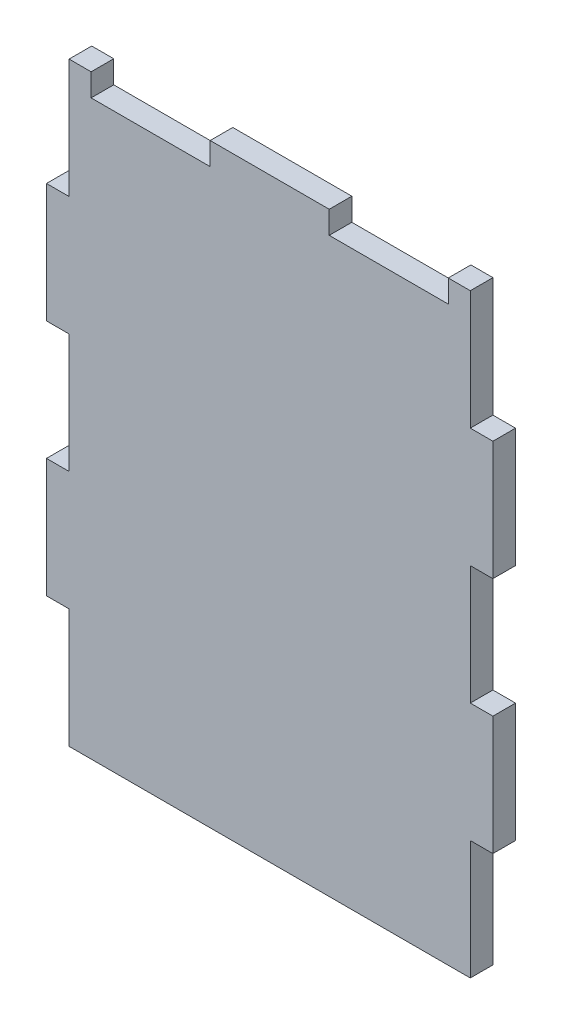
ISO-10303-21;
HEADER;
FILE_DESCRIPTION(('STEP AP214'),'2;1');
FILE_NAME('part.step','',(''),(''),'','','');
FILE_SCHEMA(('AUTOMOTIVE_DESIGN { 1 0 10303 214 1 1 1 1 }'));
ENDSEC;
DATA;
#1=APPLICATION_CONTEXT('core data for automotive mechanical design processes');
#2=APPLICATION_PROTOCOL_DEFINITION('international standard','automotive_design',2000,#1);
#3=PRODUCT_CONTEXT('',#1,'mechanical');
#4=PRODUCT('Part','Part','',(#3));
#5=PRODUCT_RELATED_PRODUCT_CATEGORY('part','',(#4));
#6=PRODUCT_DEFINITION_FORMATION('','',#4);
#7=PRODUCT_DEFINITION_CONTEXT('part definition',#1,'design');
#8=PRODUCT_DEFINITION('design','',#6,#7);
#9=PRODUCT_DEFINITION_SHAPE('','',#8);
#10=(LENGTH_UNIT() NAMED_UNIT(*) SI_UNIT(.MILLI.,.METRE.));
#11=(NAMED_UNIT(*) PLANE_ANGLE_UNIT() SI_UNIT($,.RADIAN.));
#12=(NAMED_UNIT(*) SI_UNIT($,.STERADIAN.) SOLID_ANGLE_UNIT());
#13=UNCERTAINTY_MEASURE_WITH_UNIT(LENGTH_MEASURE(1.E-05),#10,'distance_accuracy_value','');
#14=(GEOMETRIC_REPRESENTATION_CONTEXT(3) GLOBAL_UNCERTAINTY_ASSIGNED_CONTEXT((#13)) GLOBAL_UNIT_ASSIGNED_CONTEXT((#10,
#11,#12)) REPRESENTATION_CONTEXT('',''));
#15=CARTESIAN_POINT('',(0.,0.,0.));
#16=DIRECTION('',(0.,0.,1.));
#17=DIRECTION('',(1.,0.,0.));
#18=AXIS2_PLACEMENT_3D('',#15,#16,#17);
#19=CARTESIAN_POINT('',(4.826,127.,4.826));
#20=DIRECTION('',(0.,-1.,0.));
#21=DIRECTION('',(0.,0.,-1.));
#22=AXIS2_PLACEMENT_3D('',#19,#20,#21);
#23=PLANE('',#22);
#24=DIRECTION('',(0.,0.,-1.));
#25=VECTOR('',#24,1.);
#26=CARTESIAN_POINT('',(9.52500000000001,127.,0.));
#27=LINE('',#26,#25);
#28=CARTESIAN_POINT('',(9.52500000000001,127.,4.826));
#29=VERTEX_POINT('',#28);
#30=CARTESIAN_POINT('',(9.52500000000001,127.,0.));
#31=VERTEX_POINT('',#30);
#32=EDGE_CURVE('E224',#29,#31,#27,.T.);
#33=ORIENTED_EDGE('',*,*,#32,.T.);
#34=DIRECTION('',(-1.,0.,0.));
#35=VECTOR('',#34,1.);
#36=CARTESIAN_POINT('',(4.826,127.,0.));
#37=LINE('',#36,#35);
#38=CARTESIAN_POINT('',(4.826,127.,0.));
#39=VERTEX_POINT('',#38);
#40=EDGE_CURVE('E359',#31,#39,#37,.T.);
#41=ORIENTED_EDGE('',*,*,#40,.T.);
#42=DIRECTION('',(0.,0.,-1.));
#43=VECTOR('',#42,1.);
#44=CARTESIAN_POINT('',(4.826,127.,4.826));
#45=LINE('',#44,#43);
#46=CARTESIAN_POINT('',(4.826,127.,4.826));
#47=VERTEX_POINT('',#46);
#48=EDGE_CURVE('E319',#47,#39,#45,.T.);
#49=ORIENTED_EDGE('',*,*,#48,.F.);
#50=DIRECTION('',(-1.,0.,0.));
#51=VECTOR('',#50,1.);
#52=CARTESIAN_POINT('',(4.826,127.,4.826));
#53=LINE('',#52,#51);
#54=EDGE_CURVE('E315',#29,#47,#53,.T.);
#55=ORIENTED_EDGE('',*,*,#54,.F.);
#56=EDGE_LOOP('',(#33,#41,#49,#55));
#57=FACE_BOUND('',#56,.T.);
#58=ADVANCED_FACE('F33',(#57),#23,.F.);
#59=CARTESIAN_POINT('',(0.,0.,4.826));
#60=DIRECTION('',(0.,0.,1.));
#61=DIRECTION('',(1.,0.,0.));
#62=AXIS2_PLACEMENT_3D('',#59,#60,#61);
#63=PLANE('',#62);
#64=DIRECTION('',(1.,0.,0.));
#65=VECTOR('',#64,1.);
#66=CARTESIAN_POINT('',(0.,122.174,4.826));
#67=LINE('',#66,#65);
#68=CARTESIAN_POINT('',(9.52500000000001,122.174,4.826));
#69=VERTEX_POINT('',#68);
#70=CARTESIAN_POINT('',(34.925,122.174,4.826));
#71=VERTEX_POINT('',#70);
#72=EDGE_CURVE('E232',#69,#71,#67,.T.);
#73=ORIENTED_EDGE('',*,*,#72,.F.);
#74=DIRECTION('',(0.,1.,0.));
#75=VECTOR('',#74,1.);
#76=CARTESIAN_POINT('',(9.52500000000001,122.174,4.826));
#77=LINE('',#76,#75);
#78=EDGE_CURVE('E219',#69,#29,#77,.T.);
#79=ORIENTED_EDGE('',*,*,#78,.T.);
#80=ORIENTED_EDGE('',*,*,#54,.T.);
#81=DIRECTION('',(0.,-1.,0.));
#82=VECTOR('',#81,1.);
#83=CARTESIAN_POINT('',(4.826,127.,4.826));
#84=LINE('',#83,#82);
#85=CARTESIAN_POINT('',(4.826,101.6,4.826));
#86=VERTEX_POINT('',#85);
#87=EDGE_CURVE('E275',#47,#86,#84,.T.);
#88=ORIENTED_EDGE('',*,*,#87,.T.);
#89=DIRECTION('',(-1.,0.,0.));
#90=VECTOR('',#89,1.);
#91=CARTESIAN_POINT('',(0.,101.6,4.826));
#92=LINE('',#91,#90);
#93=CARTESIAN_POINT('',(0.,101.6,4.826));
#94=VERTEX_POINT('',#93);
#95=EDGE_CURVE('E278',#86,#94,#92,.T.);
#96=ORIENTED_EDGE('',*,*,#95,.T.);
#97=DIRECTION('',(0.,-1.,0.));
#98=VECTOR('',#97,1.);
#99=CARTESIAN_POINT('',(0.,76.2,4.826));
#100=LINE('',#99,#98);
#101=CARTESIAN_POINT('',(0.,76.2,4.826));
#102=VERTEX_POINT('',#101);
#103=EDGE_CURVE('E281',#94,#102,#100,.T.);
#104=ORIENTED_EDGE('',*,*,#103,.T.);
#105=DIRECTION('',(1.,0.,0.));
#106=VECTOR('',#105,1.);
#107=CARTESIAN_POINT('',(0.,76.2,4.826));
#108=LINE('',#107,#106);
#109=CARTESIAN_POINT('',(4.826,76.2,4.826));
#110=VERTEX_POINT('',#109);
#111=EDGE_CURVE('E283',#102,#110,#108,.T.);
#112=ORIENTED_EDGE('',*,*,#111,.T.);
#113=DIRECTION('',(0.,-1.,0.));
#114=VECTOR('',#113,1.);
#115=CARTESIAN_POINT('',(4.826,76.2,4.826));
#116=LINE('',#115,#114);
#117=CARTESIAN_POINT('',(4.826,50.8,4.826));
#118=VERTEX_POINT('',#117);
#119=EDGE_CURVE('E285',#110,#118,#116,.T.);
#120=ORIENTED_EDGE('',*,*,#119,.T.);
#121=DIRECTION('',(-1.,0.,0.));
#122=VECTOR('',#121,1.);
#123=CARTESIAN_POINT('',(0.,50.8,4.826));
#124=LINE('',#123,#122);
#125=CARTESIAN_POINT('',(0.,50.8,4.826));
#126=VERTEX_POINT('',#125);
#127=EDGE_CURVE('E287',#118,#126,#124,.T.);
#128=ORIENTED_EDGE('',*,*,#127,.T.);
#129=DIRECTION('',(0.,-1.,0.));
#130=VECTOR('',#129,1.);
#131=CARTESIAN_POINT('',(0.,25.4,4.826));
#132=LINE('',#131,#130);
#133=CARTESIAN_POINT('',(0.,25.4,4.826));
#134=VERTEX_POINT('',#133);
#135=EDGE_CURVE('E289',#126,#134,#132,.T.);
#136=ORIENTED_EDGE('',*,*,#135,.T.);
#137=DIRECTION('',(1.,0.,0.));
#138=VECTOR('',#137,1.);
#139=CARTESIAN_POINT('',(0.,25.4,4.826));
#140=LINE('',#139,#138);
#141=CARTESIAN_POINT('',(4.826,25.4,4.826));
#142=VERTEX_POINT('',#141);
#143=EDGE_CURVE('E291',#134,#142,#140,.T.);
#144=ORIENTED_EDGE('',*,*,#143,.T.);
#145=DIRECTION('',(0.,-1.,0.));
#146=VECTOR('',#145,1.);
#147=CARTESIAN_POINT('',(4.826,25.4,4.826));
#148=LINE('',#147,#146);
#149=CARTESIAN_POINT('',(4.826,0.,4.826));
#150=VERTEX_POINT('',#149);
#151=EDGE_CURVE('E293',#142,#150,#148,.T.);
#152=ORIENTED_EDGE('',*,*,#151,.T.);
#153=DIRECTION('',(1.,0.,0.));
#154=VECTOR('',#153,1.);
#155=CARTESIAN_POINT('',(4.826,0.,4.826));
#156=LINE('',#155,#154);
#157=CARTESIAN_POINT('',(90.424,0.,4.826));
#158=VERTEX_POINT('',#157);
#159=EDGE_CURVE('E295',#150,#158,#156,.T.);
#160=ORIENTED_EDGE('',*,*,#159,.T.);
#161=DIRECTION('',(0.,1.,0.));
#162=VECTOR('',#161,1.);
#163=CARTESIAN_POINT('',(90.424,25.4,4.826));
#164=LINE('',#163,#162);
#165=CARTESIAN_POINT('',(90.424,25.4,4.826));
#166=VERTEX_POINT('',#165);
#167=EDGE_CURVE('E297',#158,#166,#164,.T.);
#168=ORIENTED_EDGE('',*,*,#167,.T.);
#169=DIRECTION('',(1.,0.,0.));
#170=VECTOR('',#169,1.);
#171=CARTESIAN_POINT('',(95.25,25.4,4.826));
#172=LINE('',#171,#170);
#173=CARTESIAN_POINT('',(95.25,25.4,4.826));
#174=VERTEX_POINT('',#173);
#175=EDGE_CURVE('E299',#166,#174,#172,.T.);
#176=ORIENTED_EDGE('',*,*,#175,.T.);
#177=DIRECTION('',(0.,1.,0.));
#178=VECTOR('',#177,1.);
#179=CARTESIAN_POINT('',(95.25,25.4,4.826));
#180=LINE('',#179,#178);
#181=CARTESIAN_POINT('',(95.25,50.8,4.826));
#182=VERTEX_POINT('',#181);
#183=EDGE_CURVE('E301',#174,#182,#180,.T.);
#184=ORIENTED_EDGE('',*,*,#183,.T.);
#185=DIRECTION('',(-1.,0.,0.));
#186=VECTOR('',#185,1.);
#187=CARTESIAN_POINT('',(95.25,50.8,4.826));
#188=LINE('',#187,#186);
#189=CARTESIAN_POINT('',(90.424,50.8,4.826));
#190=VERTEX_POINT('',#189);
#191=EDGE_CURVE('E303',#182,#190,#188,.T.);
#192=ORIENTED_EDGE('',*,*,#191,.T.);
#193=DIRECTION('',(0.,1.,0.));
#194=VECTOR('',#193,1.);
#195=CARTESIAN_POINT('',(90.424,76.2,4.826));
#196=LINE('',#195,#194);
#197=CARTESIAN_POINT('',(90.424,76.2,4.826));
#198=VERTEX_POINT('',#197);
#199=EDGE_CURVE('E305',#190,#198,#196,.T.);
#200=ORIENTED_EDGE('',*,*,#199,.T.);
#201=DIRECTION('',(1.,0.,0.));
#202=VECTOR('',#201,1.);
#203=CARTESIAN_POINT('',(95.25,76.2,4.826));
#204=LINE('',#203,#202);
#205=CARTESIAN_POINT('',(95.25,76.2,4.826));
#206=VERTEX_POINT('',#205);
#207=EDGE_CURVE('E307',#198,#206,#204,.T.);
#208=ORIENTED_EDGE('',*,*,#207,.T.);
#209=DIRECTION('',(0.,1.,0.));
#210=VECTOR('',#209,1.);
#211=CARTESIAN_POINT('',(95.25,76.2,4.826));
#212=LINE('',#211,#210);
#213=CARTESIAN_POINT('',(95.25,101.6,4.826));
#214=VERTEX_POINT('',#213);
#215=EDGE_CURVE('E309',#206,#214,#212,.T.);
#216=ORIENTED_EDGE('',*,*,#215,.T.);
#217=DIRECTION('',(-1.,0.,0.));
#218=VECTOR('',#217,1.);
#219=CARTESIAN_POINT('',(90.424,101.6,4.826));
#220=LINE('',#219,#218);
#221=CARTESIAN_POINT('',(90.424,101.6,4.826));
#222=VERTEX_POINT('',#221);
#223=EDGE_CURVE('E311',#214,#222,#220,.T.);
#224=ORIENTED_EDGE('',*,*,#223,.T.);
#225=DIRECTION('',(0.,1.,0.));
#226=VECTOR('',#225,1.);
#227=CARTESIAN_POINT('',(90.424,127.,4.826));
#228=LINE('',#227,#226);
#229=CARTESIAN_POINT('',(90.424,127.,4.826));
#230=VERTEX_POINT('',#229);
#231=EDGE_CURVE('E313',#222,#230,#228,.T.);
#232=ORIENTED_EDGE('',*,*,#231,.T.);
#233=CARTESIAN_POINT('',(85.7250000000001,127.,4.826));
#234=VERTEX_POINT('',#233);
#235=EDGE_CURVE('E316',#230,#234,#53,.T.);
#236=ORIENTED_EDGE('',*,*,#235,.T.);
#237=DIRECTION('',(0.,1.,0.));
#238=VECTOR('',#237,1.);
#239=CARTESIAN_POINT('',(85.7250000000001,122.174,4.826));
#240=LINE('',#239,#238);
#241=CARTESIAN_POINT('',(85.7250000000001,122.174,4.826));
#242=VERTEX_POINT('',#241);
#243=EDGE_CURVE('E261',#242,#234,#240,.T.);
#244=ORIENTED_EDGE('',*,*,#243,.F.);
#245=DIRECTION('',(1.,0.,0.));
#246=VECTOR('',#245,1.);
#247=CARTESIAN_POINT('',(0.,122.174,4.826));
#248=LINE('',#247,#246);
#249=CARTESIAN_POINT('',(60.325,122.174,4.826));
#250=VERTEX_POINT('',#249);
#251=EDGE_CURVE('E253',#250,#242,#248,.T.);
#252=ORIENTED_EDGE('',*,*,#251,.F.);
#253=DIRECTION('',(0.,1.,0.));
#254=VECTOR('',#253,1.);
#255=CARTESIAN_POINT('',(60.325,122.174,4.826));
#256=LINE('',#255,#254);
#257=CARTESIAN_POINT('',(60.325,127.,4.826));
#258=VERTEX_POINT('',#257);
#259=EDGE_CURVE('E265',#250,#258,#256,.T.);
#260=ORIENTED_EDGE('',*,*,#259,.T.);
#261=CARTESIAN_POINT('',(34.925,127.,4.826));
#262=VERTEX_POINT('',#261);
#263=EDGE_CURVE('E320',#258,#262,#53,.T.);
#264=ORIENTED_EDGE('',*,*,#263,.T.);
#265=DIRECTION('',(0.,1.,0.));
#266=VECTOR('',#265,1.);
#267=CARTESIAN_POINT('',(34.925,122.174,4.826));
#268=LINE('',#267,#266);
#269=EDGE_CURVE('E228',#71,#262,#268,.T.);
#270=ORIENTED_EDGE('',*,*,#269,.F.);
#271=EDGE_LOOP('',(#73,#79,#80,#88,#96,#104,#112,#120,#128,#136,#144,#152,#160,#168,#176,#184,
#192,#200,#208,#216,#224,#232,#236,#244,#252,#260,#264,#270));
#272=FACE_BOUND('',#271,.T.);
#273=ADVANCED_FACE('F238',(#272),#63,.T.);
#274=CARTESIAN_POINT('',(0.,0.,0.));
#275=DIRECTION('',(0.,0.,1.));
#276=DIRECTION('',(1.,0.,0.));
#277=AXIS2_PLACEMENT_3D('',#274,#275,#276);
#278=PLANE('',#277);
#279=DIRECTION('',(0.,1.,0.));
#280=VECTOR('',#279,1.);
#281=CARTESIAN_POINT('',(9.52500000000001,122.174,0.));
#282=LINE('',#281,#280);
#283=CARTESIAN_POINT('',(9.52500000000001,122.174,0.));
#284=VERTEX_POINT('',#283);
#285=EDGE_CURVE('E246',#284,#31,#282,.T.);
#286=ORIENTED_EDGE('',*,*,#285,.F.);
#287=DIRECTION('',(-1.,0.,0.));
#288=VECTOR('',#287,1.);
#289=CARTESIAN_POINT('',(0.,122.174,0.));
#290=LINE('',#289,#288);
#291=CARTESIAN_POINT('',(34.925,122.174,0.));
#292=VERTEX_POINT('',#291);
#293=EDGE_CURVE('E229',#292,#284,#290,.T.);
#294=ORIENTED_EDGE('',*,*,#293,.F.);
#295=DIRECTION('',(0.,1.,0.));
#296=VECTOR('',#295,1.);
#297=CARTESIAN_POINT('',(34.925,122.174,0.));
#298=LINE('',#297,#296);
#299=CARTESIAN_POINT('',(34.925,127.,0.));
#300=VERTEX_POINT('',#299);
#301=EDGE_CURVE('E249',#292,#300,#298,.T.);
#302=ORIENTED_EDGE('',*,*,#301,.T.);
#303=CARTESIAN_POINT('',(60.325,127.,0.));
#304=VERTEX_POINT('',#303);
#305=EDGE_CURVE('E362',#304,#300,#37,.T.);
#306=ORIENTED_EDGE('',*,*,#305,.F.);
#307=DIRECTION('',(0.,1.,0.));
#308=VECTOR('',#307,1.);
#309=CARTESIAN_POINT('',(60.325,122.174,0.));
#310=LINE('',#309,#308);
#311=CARTESIAN_POINT('',(60.325,122.174,0.));
#312=VERTEX_POINT('',#311);
#313=EDGE_CURVE('E269',#312,#304,#310,.T.);
#314=ORIENTED_EDGE('',*,*,#313,.F.);
#315=DIRECTION('',(-1.,0.,0.));
#316=VECTOR('',#315,1.);
#317=CARTESIAN_POINT('',(0.,122.174,0.));
#318=LINE('',#317,#316);
#319=CARTESIAN_POINT('',(85.7250000000001,122.174,0.));
#320=VERTEX_POINT('',#319);
#321=EDGE_CURVE('E257',#320,#312,#318,.T.);
#322=ORIENTED_EDGE('',*,*,#321,.F.);
#323=DIRECTION('',(0.,1.,0.));
#324=VECTOR('',#323,1.);
#325=CARTESIAN_POINT('',(85.7250000000001,122.174,0.));
#326=LINE('',#325,#324);
#327=CARTESIAN_POINT('',(85.7250000000001,127.,0.));
#328=VERTEX_POINT('',#327);
#329=EDGE_CURVE('E271',#320,#328,#326,.T.);
#330=ORIENTED_EDGE('',*,*,#329,.T.);
#331=CARTESIAN_POINT('',(90.424,127.,0.));
#332=VERTEX_POINT('',#331);
#333=EDGE_CURVE('E279',#332,#328,#37,.T.);
#334=ORIENTED_EDGE('',*,*,#333,.F.);
#335=DIRECTION('',(0.,1.,0.));
#336=VECTOR('',#335,1.);
#337=CARTESIAN_POINT('',(90.424,127.,0.));
#338=LINE('',#337,#336);
#339=CARTESIAN_POINT('',(90.424,101.6,0.));
#340=VERTEX_POINT('',#339);
#341=EDGE_CURVE('E357',#340,#332,#338,.T.);
#342=ORIENTED_EDGE('',*,*,#341,.F.);
#343=DIRECTION('',(-1.,0.,0.));
#344=VECTOR('',#343,1.);
#345=CARTESIAN_POINT('',(90.424,101.6,0.));
#346=LINE('',#345,#344);
#347=CARTESIAN_POINT('',(95.25,101.6,0.));
#348=VERTEX_POINT('',#347);
#349=EDGE_CURVE('E355',#348,#340,#346,.T.);
#350=ORIENTED_EDGE('',*,*,#349,.F.);
#351=DIRECTION('',(0.,1.,0.));
#352=VECTOR('',#351,1.);
#353=CARTESIAN_POINT('',(95.25,76.2,0.));
#354=LINE('',#353,#352);
#355=CARTESIAN_POINT('',(95.25,76.2,0.));
#356=VERTEX_POINT('',#355);
#357=EDGE_CURVE('E353',#356,#348,#354,.T.);
#358=ORIENTED_EDGE('',*,*,#357,.F.);
#359=DIRECTION('',(1.,0.,0.));
#360=VECTOR('',#359,1.);
#361=CARTESIAN_POINT('',(95.25,76.2,0.));
#362=LINE('',#361,#360);
#363=CARTESIAN_POINT('',(90.424,76.2,0.));
#364=VERTEX_POINT('',#363);
#365=EDGE_CURVE('E351',#364,#356,#362,.T.);
#366=ORIENTED_EDGE('',*,*,#365,.F.);
#367=DIRECTION('',(0.,1.,0.));
#368=VECTOR('',#367,1.);
#369=CARTESIAN_POINT('',(90.424,76.2,0.));
#370=LINE('',#369,#368);
#371=CARTESIAN_POINT('',(90.424,50.8,0.));
#372=VERTEX_POINT('',#371);
#373=EDGE_CURVE('E349',#372,#364,#370,.T.);
#374=ORIENTED_EDGE('',*,*,#373,.F.);
#375=DIRECTION('',(-1.,0.,0.));
#376=VECTOR('',#375,1.);
#377=CARTESIAN_POINT('',(95.25,50.8,0.));
#378=LINE('',#377,#376);
#379=CARTESIAN_POINT('',(95.25,50.8,0.));
#380=VERTEX_POINT('',#379);
#381=EDGE_CURVE('E347',#380,#372,#378,.T.);
#382=ORIENTED_EDGE('',*,*,#381,.F.);
#383=DIRECTION('',(0.,1.,0.));
#384=VECTOR('',#383,1.);
#385=CARTESIAN_POINT('',(95.25,25.4,0.));
#386=LINE('',#385,#384);
#387=CARTESIAN_POINT('',(95.25,25.4,0.));
#388=VERTEX_POINT('',#387);
#389=EDGE_CURVE('E345',#388,#380,#386,.T.);
#390=ORIENTED_EDGE('',*,*,#389,.F.);
#391=DIRECTION('',(1.,0.,0.));
#392=VECTOR('',#391,1.);
#393=CARTESIAN_POINT('',(95.25,25.4,0.));
#394=LINE('',#393,#392);
#395=CARTESIAN_POINT('',(90.424,25.4,0.));
#396=VERTEX_POINT('',#395);
#397=EDGE_CURVE('E343',#396,#388,#394,.T.);
#398=ORIENTED_EDGE('',*,*,#397,.F.);
#399=DIRECTION('',(0.,1.,0.));
#400=VECTOR('',#399,1.);
#401=CARTESIAN_POINT('',(90.424,25.4,0.));
#402=LINE('',#401,#400);
#403=CARTESIAN_POINT('',(90.424,0.,0.));
#404=VERTEX_POINT('',#403);
#405=EDGE_CURVE('E341',#404,#396,#402,.T.);
#406=ORIENTED_EDGE('',*,*,#405,.F.);
#407=DIRECTION('',(1.,0.,0.));
#408=VECTOR('',#407,1.);
#409=CARTESIAN_POINT('',(4.826,0.,0.));
#410=LINE('',#409,#408);
#411=CARTESIAN_POINT('',(4.826,0.,0.));
#412=VERTEX_POINT('',#411);
#413=EDGE_CURVE('E339',#412,#404,#410,.T.);
#414=ORIENTED_EDGE('',*,*,#413,.F.);
#415=DIRECTION('',(0.,-1.,0.));
#416=VECTOR('',#415,1.);
#417=CARTESIAN_POINT('',(4.826,25.4,0.));
#418=LINE('',#417,#416);
#419=CARTESIAN_POINT('',(4.826,25.4,0.));
#420=VERTEX_POINT('',#419);
#421=EDGE_CURVE('E337',#420,#412,#418,.T.);
#422=ORIENTED_EDGE('',*,*,#421,.F.);
#423=DIRECTION('',(1.,0.,0.));
#424=VECTOR('',#423,1.);
#425=CARTESIAN_POINT('',(0.,25.4,0.));
#426=LINE('',#425,#424);
#427=CARTESIAN_POINT('',(0.,25.4,0.));
#428=VERTEX_POINT('',#427);
#429=EDGE_CURVE('E335',#428,#420,#426,.T.);
#430=ORIENTED_EDGE('',*,*,#429,.F.);
#431=DIRECTION('',(0.,-1.,0.));
#432=VECTOR('',#431,1.);
#433=CARTESIAN_POINT('',(0.,25.4,0.));
#434=LINE('',#433,#432);
#435=CARTESIAN_POINT('',(0.,50.8,0.));
#436=VERTEX_POINT('',#435);
#437=EDGE_CURVE('E333',#436,#428,#434,.T.);
#438=ORIENTED_EDGE('',*,*,#437,.F.);
#439=DIRECTION('',(-1.,0.,0.));
#440=VECTOR('',#439,1.);
#441=CARTESIAN_POINT('',(0.,50.8,0.));
#442=LINE('',#441,#440);
#443=CARTESIAN_POINT('',(4.826,50.8,0.));
#444=VERTEX_POINT('',#443);
#445=EDGE_CURVE('E331',#444,#436,#442,.T.);
#446=ORIENTED_EDGE('',*,*,#445,.F.);
#447=DIRECTION('',(0.,-1.,0.));
#448=VECTOR('',#447,1.);
#449=CARTESIAN_POINT('',(4.826,76.2,0.));
#450=LINE('',#449,#448);
#451=CARTESIAN_POINT('',(4.826,76.2,0.));
#452=VERTEX_POINT('',#451);
#453=EDGE_CURVE('E329',#452,#444,#450,.T.);
#454=ORIENTED_EDGE('',*,*,#453,.F.);
#455=DIRECTION('',(1.,0.,0.));
#456=VECTOR('',#455,1.);
#457=CARTESIAN_POINT('',(0.,76.2,0.));
#458=LINE('',#457,#456);
#459=CARTESIAN_POINT('',(0.,76.2,0.));
#460=VERTEX_POINT('',#459);
#461=EDGE_CURVE('E327',#460,#452,#458,.T.);
#462=ORIENTED_EDGE('',*,*,#461,.F.);
#463=DIRECTION('',(0.,-1.,0.));
#464=VECTOR('',#463,1.);
#465=CARTESIAN_POINT('',(0.,76.2,0.));
#466=LINE('',#465,#464);
#467=CARTESIAN_POINT('',(0.,101.6,0.));
#468=VERTEX_POINT('',#467);
#469=EDGE_CURVE('E325',#468,#460,#466,.T.);
#470=ORIENTED_EDGE('',*,*,#469,.F.);
#471=DIRECTION('',(-1.,0.,0.));
#472=VECTOR('',#471,1.);
#473=CARTESIAN_POINT('',(0.,101.6,0.));
#474=LINE('',#473,#472);
#475=CARTESIAN_POINT('',(4.826,101.6,0.));
#476=VERTEX_POINT('',#475);
#477=EDGE_CURVE('E323',#476,#468,#474,.T.);
#478=ORIENTED_EDGE('',*,*,#477,.F.);
#479=DIRECTION('',(0.,-1.,0.));
#480=VECTOR('',#479,1.);
#481=CARTESIAN_POINT('',(4.826,127.,0.));
#482=LINE('',#481,#480);
#483=EDGE_CURVE('E268',#39,#476,#482,.T.);
#484=ORIENTED_EDGE('',*,*,#483,.F.);
#485=ORIENTED_EDGE('',*,*,#40,.F.);
#486=EDGE_LOOP('',(#286,#294,#302,#306,#314,#322,#330,#334,#342,#350,#358,#366,#374,#382,#390,
#398,#406,#414,#422,#430,#438,#446,#454,#462,#470,#478,#484,#485));
#487=FACE_BOUND('',#486,.T.);
#488=ADVANCED_FACE('F425',(#487),#278,.F.);
#489=ORIENTED_EDGE('',*,*,#305,.T.);
#490=DIRECTION('',(0.,0.,-1.));
#491=VECTOR('',#490,1.);
#492=CARTESIAN_POINT('',(34.925,127.,0.));
#493=LINE('',#492,#491);
#494=EDGE_CURVE('E236',#262,#300,#493,.T.);
#495=ORIENTED_EDGE('',*,*,#494,.F.);
#496=ORIENTED_EDGE('',*,*,#263,.F.);
#497=DIRECTION('',(0.,0.,-1.));
#498=VECTOR('',#497,1.);
#499=CARTESIAN_POINT('',(60.325,127.,0.));
#500=LINE('',#499,#498);
#501=EDGE_CURVE('E255',#258,#304,#500,.T.);
#502=ORIENTED_EDGE('',*,*,#501,.T.);
#503=EDGE_LOOP('',(#489,#495,#496,#502));
#504=FACE_BOUND('',#503,.T.);
#505=ADVANCED_FACE('F450',(#504),#23,.F.);
#506=CARTESIAN_POINT('',(4.826,127.,4.826));
#507=DIRECTION('',(1.,0.,0.));
#508=DIRECTION('',(0.,0.,-1.));
#509=AXIS2_PLACEMENT_3D('',#506,#507,#508);
#510=PLANE('',#509);
#511=ORIENTED_EDGE('',*,*,#483,.T.);
#512=DIRECTION('',(0.,0.,-1.));
#513=VECTOR('',#512,1.);
#514=CARTESIAN_POINT('',(4.826,101.6,4.826));
#515=LINE('',#514,#513);
#516=EDGE_CURVE('E11',#86,#476,#515,.T.);
#517=ORIENTED_EDGE('',*,*,#516,.F.);
#518=ORIENTED_EDGE('',*,*,#87,.F.);
#519=ORIENTED_EDGE('',*,*,#48,.T.);
#520=EDGE_LOOP('',(#511,#517,#518,#519));
#521=FACE_BOUND('',#520,.T.);
#522=ADVANCED_FACE('F35',(#521),#510,.F.);
#523=CARTESIAN_POINT('',(0.,101.6,4.826));
#524=DIRECTION('',(0.,-1.,0.));
#525=DIRECTION('',(0.,0.,-1.));
#526=AXIS2_PLACEMENT_3D('',#523,#524,#525);
#527=PLANE('',#526);
#528=ORIENTED_EDGE('',*,*,#477,.T.);
#529=DIRECTION('',(0.,0.,-1.));
#530=VECTOR('',#529,1.);
#531=CARTESIAN_POINT('',(0.,101.6,4.826));
#532=LINE('',#531,#530);
#533=EDGE_CURVE('E41',#94,#468,#532,.T.);
#534=ORIENTED_EDGE('',*,*,#533,.F.);
#535=ORIENTED_EDGE('',*,*,#95,.F.);
#536=ORIENTED_EDGE('',*,*,#516,.T.);
#537=EDGE_LOOP('',(#528,#534,#535,#536));
#538=FACE_BOUND('',#537,.T.);
#539=ADVANCED_FACE('F441',(#538),#527,.F.);
#540=CARTESIAN_POINT('',(0.,76.2,4.826));
#541=DIRECTION('',(1.,0.,0.));
#542=DIRECTION('',(0.,0.,-1.));
#543=AXIS2_PLACEMENT_3D('',#540,#541,#542);
#544=PLANE('',#543);
#545=ORIENTED_EDGE('',*,*,#469,.T.);
#546=DIRECTION('',(0.,0.,-1.));
#547=VECTOR('',#546,1.);
#548=CARTESIAN_POINT('',(0.,76.2,4.826));
#549=LINE('',#548,#547);
#550=EDGE_CURVE('E413',#102,#460,#549,.T.);
#551=ORIENTED_EDGE('',*,*,#550,.F.);
#552=ORIENTED_EDGE('',*,*,#103,.F.);
#553=ORIENTED_EDGE('',*,*,#533,.T.);
#554=EDGE_LOOP('',(#545,#551,#552,#553));
#555=FACE_BOUND('',#554,.T.);
#556=ADVANCED_FACE('F420',(#555),#544,.F.);
#557=CARTESIAN_POINT('',(0.,76.2,4.826));
#558=DIRECTION('',(0.,1.,0.));
#559=DIRECTION('',(0.,0.,1.));
#560=AXIS2_PLACEMENT_3D('',#557,#558,#559);
#561=PLANE('',#560);
#562=ORIENTED_EDGE('',*,*,#461,.T.);
#563=DIRECTION('',(0.,0.,-1.));
#564=VECTOR('',#563,1.);
#565=CARTESIAN_POINT('',(4.826,76.2,4.826));
#566=LINE('',#565,#564);
#567=EDGE_CURVE('E410',#110,#452,#566,.T.);
#568=ORIENTED_EDGE('',*,*,#567,.F.);
#569=ORIENTED_EDGE('',*,*,#111,.F.);
#570=ORIENTED_EDGE('',*,*,#550,.T.);
#571=EDGE_LOOP('',(#562,#568,#569,#570));
#572=FACE_BOUND('',#571,.T.);
#573=ADVANCED_FACE('F431',(#572),#561,.F.);
#574=CARTESIAN_POINT('',(4.826,76.2,4.826));
#575=DIRECTION('',(1.,0.,0.));
#576=DIRECTION('',(0.,0.,-1.));
#577=AXIS2_PLACEMENT_3D('',#574,#575,#576);
#578=PLANE('',#577);
#579=ORIENTED_EDGE('',*,*,#453,.T.);
#580=DIRECTION('',(0.,0.,-1.));
#581=VECTOR('',#580,1.);
#582=CARTESIAN_POINT('',(4.826,50.8,4.826));
#583=LINE('',#582,#581);
#584=EDGE_CURVE('E407',#118,#444,#583,.T.);
#585=ORIENTED_EDGE('',*,*,#584,.F.);
#586=ORIENTED_EDGE('',*,*,#119,.F.);
#587=ORIENTED_EDGE('',*,*,#567,.T.);
#588=EDGE_LOOP('',(#579,#585,#586,#587));
#589=FACE_BOUND('',#588,.T.);
#590=ADVANCED_FACE('F435',(#589),#578,.F.);
#591=CARTESIAN_POINT('',(0.,50.8,4.826));
#592=DIRECTION('',(0.,-1.,0.));
#593=DIRECTION('',(0.,0.,-1.));
#594=AXIS2_PLACEMENT_3D('',#591,#592,#593);
#595=PLANE('',#594);
#596=ORIENTED_EDGE('',*,*,#445,.T.);
#597=DIRECTION('',(0.,0.,-1.));
#598=VECTOR('',#597,1.);
#599=CARTESIAN_POINT('',(0.,50.8,4.826));
#600=LINE('',#599,#598);
#601=EDGE_CURVE('E404',#126,#436,#600,.T.);
#602=ORIENTED_EDGE('',*,*,#601,.F.);
#603=ORIENTED_EDGE('',*,*,#127,.F.);
#604=ORIENTED_EDGE('',*,*,#584,.T.);
#605=EDGE_LOOP('',(#596,#602,#603,#604));
#606=FACE_BOUND('',#605,.T.);
#607=ADVANCED_FACE('F559',(#606),#595,.F.);
#608=CARTESIAN_POINT('',(0.,25.4,4.826));
#609=DIRECTION('',(1.,0.,0.));
#610=DIRECTION('',(0.,0.,-1.));
#611=AXIS2_PLACEMENT_3D('',#608,#609,#610);
#612=PLANE('',#611);
#613=ORIENTED_EDGE('',*,*,#437,.T.);
#614=DIRECTION('',(0.,0.,-1.));
#615=VECTOR('',#614,1.);
#616=CARTESIAN_POINT('',(0.,25.4,4.826));
#617=LINE('',#616,#615);
#618=EDGE_CURVE('E401',#134,#428,#617,.T.);
#619=ORIENTED_EDGE('',*,*,#618,.F.);
#620=ORIENTED_EDGE('',*,*,#135,.F.);
#621=ORIENTED_EDGE('',*,*,#601,.T.);
#622=EDGE_LOOP('',(#613,#619,#620,#621));
#623=FACE_BOUND('',#622,.T.);
#624=ADVANCED_FACE('F557',(#623),#612,.F.);
#625=CARTESIAN_POINT('',(0.,25.4,4.826));
#626=DIRECTION('',(0.,1.,0.));
#627=DIRECTION('',(0.,0.,1.));
#628=AXIS2_PLACEMENT_3D('',#625,#626,#627);
#629=PLANE('',#628);
#630=ORIENTED_EDGE('',*,*,#429,.T.);
#631=DIRECTION('',(0.,0.,-1.));
#632=VECTOR('',#631,1.);
#633=CARTESIAN_POINT('',(4.826,25.4,4.826));
#634=LINE('',#633,#632);
#635=EDGE_CURVE('E398',#142,#420,#634,.T.);
#636=ORIENTED_EDGE('',*,*,#635,.F.);
#637=ORIENTED_EDGE('',*,*,#143,.F.);
#638=ORIENTED_EDGE('',*,*,#618,.T.);
#639=EDGE_LOOP('',(#630,#636,#637,#638));
#640=FACE_BOUND('',#639,.T.);
#641=ADVANCED_FACE('F552',(#640),#629,.F.);
#642=CARTESIAN_POINT('',(4.826,25.4,4.826));
#643=DIRECTION('',(1.,0.,0.));
#644=DIRECTION('',(0.,0.,-1.));
#645=AXIS2_PLACEMENT_3D('',#642,#643,#644);
#646=PLANE('',#645);
#647=ORIENTED_EDGE('',*,*,#421,.T.);
#648=DIRECTION('',(0.,0.,-1.));
#649=VECTOR('',#648,1.);
#650=CARTESIAN_POINT('',(4.826,0.,4.826));
#651=LINE('',#650,#649);
#652=EDGE_CURVE('E395',#150,#412,#651,.T.);
#653=ORIENTED_EDGE('',*,*,#652,.F.);
#654=ORIENTED_EDGE('',*,*,#151,.F.);
#655=ORIENTED_EDGE('',*,*,#635,.T.);
#656=EDGE_LOOP('',(#647,#653,#654,#655));
#657=FACE_BOUND('',#656,.T.);
#658=ADVANCED_FACE('F547',(#657),#646,.F.);
#659=CARTESIAN_POINT('',(4.826,0.,4.826));
#660=DIRECTION('',(0.,1.,0.));
#661=DIRECTION('',(0.,0.,1.));
#662=AXIS2_PLACEMENT_3D('',#659,#660,#661);
#663=PLANE('',#662);
#664=ORIENTED_EDGE('',*,*,#413,.T.);
#665=DIRECTION('',(0.,0.,-1.));
#666=VECTOR('',#665,1.);
#667=CARTESIAN_POINT('',(90.424,0.,4.826));
#668=LINE('',#667,#666);
#669=EDGE_CURVE('E392',#158,#404,#668,.T.);
#670=ORIENTED_EDGE('',*,*,#669,.F.);
#671=ORIENTED_EDGE('',*,*,#159,.F.);
#672=ORIENTED_EDGE('',*,*,#652,.T.);
#673=EDGE_LOOP('',(#664,#670,#671,#672));
#674=FACE_BOUND('',#673,.T.);
#675=ADVANCED_FACE('F543',(#674),#663,.F.);
#676=CARTESIAN_POINT('',(90.424,25.4,4.826));
#677=DIRECTION('',(-1.,0.,0.));
#678=DIRECTION('',(0.,0.,1.));
#679=AXIS2_PLACEMENT_3D('',#676,#677,#678);
#680=PLANE('',#679);
#681=ORIENTED_EDGE('',*,*,#405,.T.);
#682=DIRECTION('',(0.,0.,-1.));
#683=VECTOR('',#682,1.);
#684=CARTESIAN_POINT('',(90.424,25.4,4.826));
#685=LINE('',#684,#683);
#686=EDGE_CURVE('E389',#166,#396,#685,.T.);
#687=ORIENTED_EDGE('',*,*,#686,.F.);
#688=ORIENTED_EDGE('',*,*,#167,.F.);
#689=ORIENTED_EDGE('',*,*,#669,.T.);
#690=EDGE_LOOP('',(#681,#687,#688,#689));
#691=FACE_BOUND('',#690,.T.);
#692=ADVANCED_FACE('F538',(#691),#680,.F.);
#693=CARTESIAN_POINT('',(95.25,25.4,4.826));
#694=DIRECTION('',(0.,1.,0.));
#695=DIRECTION('',(-1.,0.,0.));
#696=AXIS2_PLACEMENT_3D('',#693,#694,#695);
#697=PLANE('',#696);
#698=ORIENTED_EDGE('',*,*,#397,.T.);
#699=DIRECTION('',(0.,0.,-1.));
#700=VECTOR('',#699,1.);
#701=CARTESIAN_POINT('',(95.25,25.4,4.826));
#702=LINE('',#701,#700);
#703=EDGE_CURVE('E386',#174,#388,#702,.T.);
#704=ORIENTED_EDGE('',*,*,#703,.F.);
#705=ORIENTED_EDGE('',*,*,#175,.F.);
#706=ORIENTED_EDGE('',*,*,#686,.T.);
#707=EDGE_LOOP('',(#698,#704,#705,#706));
#708=FACE_BOUND('',#707,.T.);
#709=ADVANCED_FACE('F532',(#708),#697,.F.);
#710=CARTESIAN_POINT('',(95.25,25.4,4.826));
#711=DIRECTION('',(-1.,0.,0.));
#712=DIRECTION('',(0.,0.,1.));
#713=AXIS2_PLACEMENT_3D('',#710,#711,#712);
#714=PLANE('',#713);
#715=ORIENTED_EDGE('',*,*,#389,.T.);
#716=DIRECTION('',(0.,0.,-1.));
#717=VECTOR('',#716,1.);
#718=CARTESIAN_POINT('',(95.25,50.8,4.826));
#719=LINE('',#718,#717);
#720=EDGE_CURVE('E383',#182,#380,#719,.T.);
#721=ORIENTED_EDGE('',*,*,#720,.F.);
#722=ORIENTED_EDGE('',*,*,#183,.F.);
#723=ORIENTED_EDGE('',*,*,#703,.T.);
#724=EDGE_LOOP('',(#715,#721,#722,#723));
#725=FACE_BOUND('',#724,.T.);
#726=ADVANCED_FACE('F528',(#725),#714,.F.);
#727=CARTESIAN_POINT('',(95.25,50.8,4.826));
#728=DIRECTION('',(0.,-1.,0.));
#729=DIRECTION('',(0.,0.,-1.));
#730=AXIS2_PLACEMENT_3D('',#727,#728,#729);
#731=PLANE('',#730);
#732=ORIENTED_EDGE('',*,*,#381,.T.);
#733=DIRECTION('',(0.,0.,-1.));
#734=VECTOR('',#733,1.);
#735=CARTESIAN_POINT('',(90.424,50.8,4.826));
#736=LINE('',#735,#734);
#737=EDGE_CURVE('E380',#190,#372,#736,.T.);
#738=ORIENTED_EDGE('',*,*,#737,.F.);
#739=ORIENTED_EDGE('',*,*,#191,.F.);
#740=ORIENTED_EDGE('',*,*,#720,.T.);
#741=EDGE_LOOP('',(#732,#738,#739,#740));
#742=FACE_BOUND('',#741,.T.);
#743=ADVANCED_FACE('F523',(#742),#731,.F.);
#744=CARTESIAN_POINT('',(90.424,76.2,4.826));
#745=DIRECTION('',(-1.,0.,0.));
#746=DIRECTION('',(0.,0.,1.));
#747=AXIS2_PLACEMENT_3D('',#744,#745,#746);
#748=PLANE('',#747);
#749=ORIENTED_EDGE('',*,*,#373,.T.);
#750=DIRECTION('',(0.,0.,-1.));
#751=VECTOR('',#750,1.);
#752=CARTESIAN_POINT('',(90.424,76.2,4.826));
#753=LINE('',#752,#751);
#754=EDGE_CURVE('E377',#198,#364,#753,.T.);
#755=ORIENTED_EDGE('',*,*,#754,.F.);
#756=ORIENTED_EDGE('',*,*,#199,.F.);
#757=ORIENTED_EDGE('',*,*,#737,.T.);
#758=EDGE_LOOP('',(#749,#755,#756,#757));
#759=FACE_BOUND('',#758,.T.);
#760=ADVANCED_FACE('F517',(#759),#748,.F.);
#761=CARTESIAN_POINT('',(95.25,76.2,4.826));
#762=DIRECTION('',(0.,1.,0.));
#763=DIRECTION('',(0.,0.,1.));
#764=AXIS2_PLACEMENT_3D('',#761,#762,#763);
#765=PLANE('',#764);
#766=ORIENTED_EDGE('',*,*,#365,.T.);
#767=DIRECTION('',(0.,0.,-1.));
#768=VECTOR('',#767,1.);
#769=CARTESIAN_POINT('',(95.25,76.2,4.826));
#770=LINE('',#769,#768);
#771=EDGE_CURVE('E374',#206,#356,#770,.T.);
#772=ORIENTED_EDGE('',*,*,#771,.F.);
#773=ORIENTED_EDGE('',*,*,#207,.F.);
#774=ORIENTED_EDGE('',*,*,#754,.T.);
#775=EDGE_LOOP('',(#766,#772,#773,#774));
#776=FACE_BOUND('',#775,.T.);
#777=ADVANCED_FACE('F513',(#776),#765,.F.);
#778=CARTESIAN_POINT('',(95.25,76.2,4.826));
#779=DIRECTION('',(-1.,0.,0.));
#780=DIRECTION('',(0.,0.,1.));
#781=AXIS2_PLACEMENT_3D('',#778,#779,#780);
#782=PLANE('',#781);
#783=ORIENTED_EDGE('',*,*,#357,.T.);
#784=DIRECTION('',(0.,0.,-1.));
#785=VECTOR('',#784,1.);
#786=CARTESIAN_POINT('',(95.25,101.6,4.826));
#787=LINE('',#786,#785);
#788=EDGE_CURVE('E371',#214,#348,#787,.T.);
#789=ORIENTED_EDGE('',*,*,#788,.F.);
#790=ORIENTED_EDGE('',*,*,#215,.F.);
#791=ORIENTED_EDGE('',*,*,#771,.T.);
#792=EDGE_LOOP('',(#783,#789,#790,#791));
#793=FACE_BOUND('',#792,.T.);
#794=ADVANCED_FACE('F508',(#793),#782,.F.);
#795=CARTESIAN_POINT('',(90.424,101.6,4.826));
#796=DIRECTION('',(0.,-1.,0.));
#797=DIRECTION('',(0.,0.,-1.));
#798=AXIS2_PLACEMENT_3D('',#795,#796,#797);
#799=PLANE('',#798);
#800=ORIENTED_EDGE('',*,*,#349,.T.);
#801=DIRECTION('',(0.,0.,-1.));
#802=VECTOR('',#801,1.);
#803=CARTESIAN_POINT('',(90.424,101.6,4.826));
#804=LINE('',#803,#802);
#805=EDGE_CURVE('E368',#222,#340,#804,.T.);
#806=ORIENTED_EDGE('',*,*,#805,.F.);
#807=ORIENTED_EDGE('',*,*,#223,.F.);
#808=ORIENTED_EDGE('',*,*,#788,.T.);
#809=EDGE_LOOP('',(#800,#806,#807,#808));
#810=FACE_BOUND('',#809,.T.);
#811=ADVANCED_FACE('F488',(#810),#799,.F.);
#812=CARTESIAN_POINT('',(90.424,127.,4.826));
#813=DIRECTION('',(-1.,0.,0.));
#814=DIRECTION('',(0.,0.,1.));
#815=AXIS2_PLACEMENT_3D('',#812,#813,#814);
#816=PLANE('',#815);
#817=ORIENTED_EDGE('',*,*,#341,.T.);
#818=DIRECTION('',(0.,0.,-1.));
#819=VECTOR('',#818,1.);
#820=CARTESIAN_POINT('',(90.424,127.,4.826));
#821=LINE('',#820,#819);
#822=EDGE_CURVE('E365',#230,#332,#821,.T.);
#823=ORIENTED_EDGE('',*,*,#822,.F.);
#824=ORIENTED_EDGE('',*,*,#231,.F.);
#825=ORIENTED_EDGE('',*,*,#805,.T.);
#826=EDGE_LOOP('',(#817,#823,#824,#825));
#827=FACE_BOUND('',#826,.T.);
#828=ADVANCED_FACE('F478',(#827),#816,.F.);
#829=ORIENTED_EDGE('',*,*,#333,.T.);
#830=DIRECTION('',(0.,0.,-1.));
#831=VECTOR('',#830,1.);
#832=CARTESIAN_POINT('',(85.7250000000001,127.,0.));
#833=LINE('',#832,#831);
#834=EDGE_CURVE('E248',#234,#328,#833,.T.);
#835=ORIENTED_EDGE('',*,*,#834,.F.);
#836=ORIENTED_EDGE('',*,*,#235,.F.);
#837=ORIENTED_EDGE('',*,*,#822,.T.);
#838=EDGE_LOOP('',(#829,#835,#836,#837));
#839=FACE_BOUND('',#838,.T.);
#840=ADVANCED_FACE('F467',(#839),#23,.F.);
#841=CARTESIAN_POINT('',(60.325,122.174,0.));
#842=DIRECTION('',(1.,0.,0.));
#843=DIRECTION('',(0.,0.,-1.));
#844=AXIS2_PLACEMENT_3D('',#841,#842,#843);
#845=PLANE('',#844);
#846=ORIENTED_EDGE('',*,*,#501,.F.);
#847=ORIENTED_EDGE('',*,*,#259,.F.);
#848=DIRECTION('',(0.,0.,-1.));
#849=VECTOR('',#848,1.);
#850=CARTESIAN_POINT('',(60.325,122.174,0.));
#851=LINE('',#850,#849);
#852=EDGE_CURVE('E259',#250,#312,#851,.T.);
#853=ORIENTED_EDGE('',*,*,#852,.T.);
#854=ORIENTED_EDGE('',*,*,#313,.T.);
#855=EDGE_LOOP('',(#846,#847,#853,#854));
#856=FACE_BOUND('',#855,.T.);
#857=ADVANCED_FACE('F477',(#856),#845,.T.);
#858=CARTESIAN_POINT('',(85.7250000000001,122.174,0.));
#859=DIRECTION('',(1.,0.,0.));
#860=DIRECTION('',(0.,0.,-1.));
#861=AXIS2_PLACEMENT_3D('',#858,#859,#860);
#862=PLANE('',#861);
#863=ORIENTED_EDGE('',*,*,#834,.T.);
#864=ORIENTED_EDGE('',*,*,#329,.F.);
#865=DIRECTION('',(0.,0.,-1.));
#866=VECTOR('',#865,1.);
#867=CARTESIAN_POINT('',(85.7250000000001,122.174,0.));
#868=LINE('',#867,#866);
#869=EDGE_CURVE('E56',#242,#320,#868,.T.);
#870=ORIENTED_EDGE('',*,*,#869,.F.);
#871=ORIENTED_EDGE('',*,*,#243,.T.);
#872=EDGE_LOOP('',(#863,#864,#870,#871));
#873=FACE_BOUND('',#872,.T.);
#874=ADVANCED_FACE('F484',(#873),#862,.F.);
#875=CARTESIAN_POINT('',(0.,122.174,0.));
#876=DIRECTION('',(0.,1.,0.));
#877=DIRECTION('',(0.,0.,1.));
#878=AXIS2_PLACEMENT_3D('',#875,#876,#877);
#879=PLANE('',#878);
#880=ORIENTED_EDGE('',*,*,#251,.T.);
#881=ORIENTED_EDGE('',*,*,#869,.T.);
#882=ORIENTED_EDGE('',*,*,#321,.T.);
#883=ORIENTED_EDGE('',*,*,#852,.F.);
#884=EDGE_LOOP('',(#880,#881,#882,#883));
#885=FACE_BOUND('',#884,.T.);
#886=ADVANCED_FACE('F463',(#885),#879,.T.);
#887=CARTESIAN_POINT('',(9.52500000000001,122.174,0.));
#888=DIRECTION('',(1.,0.,0.));
#889=DIRECTION('',(0.,0.,-1.));
#890=AXIS2_PLACEMENT_3D('',#887,#888,#889);
#891=PLANE('',#890);
#892=ORIENTED_EDGE('',*,*,#32,.F.);
#893=ORIENTED_EDGE('',*,*,#78,.F.);
#894=DIRECTION('',(0.,0.,-1.));
#895=VECTOR('',#894,1.);
#896=CARTESIAN_POINT('',(9.52500000000001,122.174,0.));
#897=LINE('',#896,#895);
#898=EDGE_CURVE('E222',#69,#284,#897,.T.);
#899=ORIENTED_EDGE('',*,*,#898,.T.);
#900=ORIENTED_EDGE('',*,*,#285,.T.);
#901=EDGE_LOOP('',(#892,#893,#899,#900));
#902=FACE_BOUND('',#901,.T.);
#903=ADVANCED_FACE('F221',(#902),#891,.T.);
#904=CARTESIAN_POINT('',(34.925,122.174,0.));
#905=DIRECTION('',(1.,0.,0.));
#906=DIRECTION('',(0.,0.,-1.));
#907=AXIS2_PLACEMENT_3D('',#904,#905,#906);
#908=PLANE('',#907);
#909=ORIENTED_EDGE('',*,*,#494,.T.);
#910=ORIENTED_EDGE('',*,*,#301,.F.);
#911=DIRECTION('',(0.,0.,-1.));
#912=VECTOR('',#911,1.);
#913=CARTESIAN_POINT('',(34.925,122.174,0.));
#914=LINE('',#913,#912);
#915=EDGE_CURVE('E48',#71,#292,#914,.T.);
#916=ORIENTED_EDGE('',*,*,#915,.F.);
#917=ORIENTED_EDGE('',*,*,#269,.T.);
#918=EDGE_LOOP('',(#909,#910,#916,#917));
#919=FACE_BOUND('',#918,.T.);
#920=ADVANCED_FACE('F455',(#919),#908,.F.);
#921=CARTESIAN_POINT('',(0.,122.174,0.));
#922=DIRECTION('',(0.,1.,0.));
#923=DIRECTION('',(0.,0.,1.));
#924=AXIS2_PLACEMENT_3D('',#921,#922,#923);
#925=PLANE('',#924);
#926=ORIENTED_EDGE('',*,*,#898,.F.);
#927=ORIENTED_EDGE('',*,*,#72,.T.);
#928=ORIENTED_EDGE('',*,*,#915,.T.);
#929=ORIENTED_EDGE('',*,*,#293,.T.);
#930=EDGE_LOOP('',(#926,#927,#928,#929));
#931=FACE_BOUND('',#930,.T.);
#932=ADVANCED_FACE('F231',(#931),#925,.T.);
#933=CLOSED_SHELL('',(#58,#273,#488,#505,#522,#539,#556,#573,#590,#607,#624,#641,#658,#675,#692,
#709,#726,#743,#760,#777,#794,#811,#828,#840,#857,#874,#886,#903,#920,#932));
#934=MANIFOLD_SOLID_BREP('B2',#933);
#935=ADVANCED_BREP_SHAPE_REPRESENTATION('',(#18,#934),#14);
#936=SHAPE_DEFINITION_REPRESENTATION(#9,#935);
ENDSEC;
END-ISO-10303-21;
